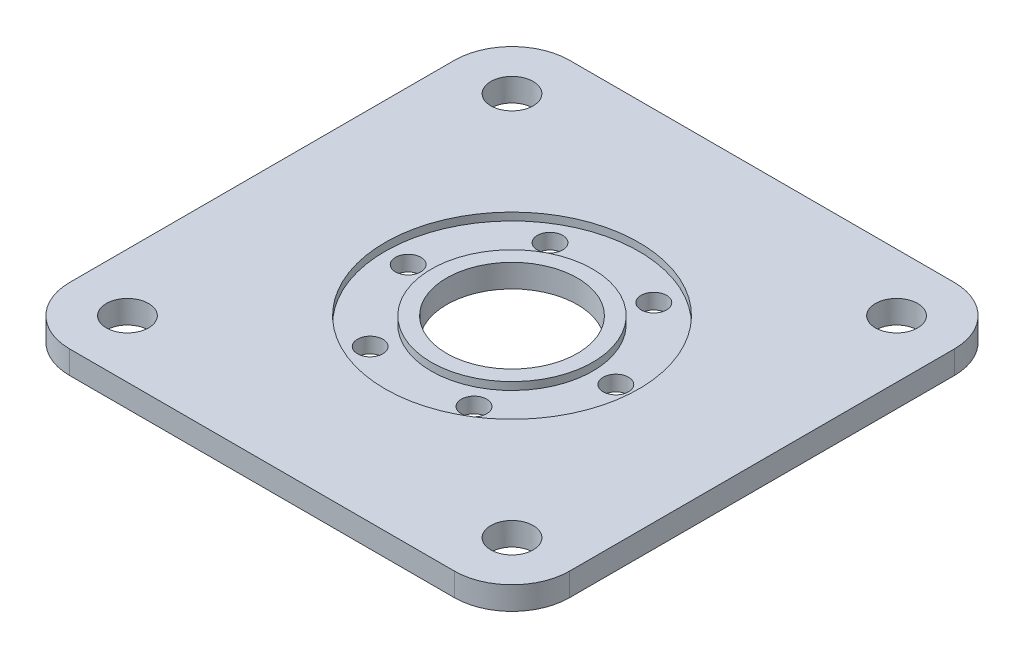
ISO-10303-21;
HEADER;
FILE_DESCRIPTION(('STEP AP214'),'2;1');
FILE_NAME('part.step','',(''),(''),'','','');
FILE_SCHEMA(('AUTOMOTIVE_DESIGN { 1 0 10303 214 1 1 1 1 }'));
ENDSEC;
DATA;
#1=APPLICATION_CONTEXT('core data for automotive mechanical design processes');
#2=APPLICATION_PROTOCOL_DEFINITION('international standard','automotive_design',2000,#1);
#3=PRODUCT_CONTEXT('',#1,'mechanical');
#4=PRODUCT('Part','Part','',(#3));
#5=PRODUCT_RELATED_PRODUCT_CATEGORY('part','',(#4));
#6=PRODUCT_DEFINITION_FORMATION('','',#4);
#7=PRODUCT_DEFINITION_CONTEXT('part definition',#1,'design');
#8=PRODUCT_DEFINITION('design','',#6,#7);
#9=PRODUCT_DEFINITION_SHAPE('','',#8);
#10=(LENGTH_UNIT() NAMED_UNIT(*) SI_UNIT(.MILLI.,.METRE.));
#11=(NAMED_UNIT(*) PLANE_ANGLE_UNIT() SI_UNIT($,.RADIAN.));
#12=(NAMED_UNIT(*) SI_UNIT($,.STERADIAN.) SOLID_ANGLE_UNIT());
#13=UNCERTAINTY_MEASURE_WITH_UNIT(LENGTH_MEASURE(1.E-05),#10,'distance_accuracy_value','');
#14=(GEOMETRIC_REPRESENTATION_CONTEXT(3) GLOBAL_UNCERTAINTY_ASSIGNED_CONTEXT((#13)) GLOBAL_UNIT_ASSIGNED_CONTEXT((#10,
#11,#12)) REPRESENTATION_CONTEXT('',''));
#15=CARTESIAN_POINT('',(0.,0.,0.));
#16=DIRECTION('',(0.,0.,1.));
#17=DIRECTION('',(1.,0.,0.));
#18=AXIS2_PLACEMENT_3D('',#15,#16,#17);
#19=CARTESIAN_POINT('',(-50.,6.,50.));
#20=DIRECTION('',(0.,-1.,0.));
#21=DIRECTION('',(0.,0.,-1.));
#22=AXIS2_PLACEMENT_3D('',#19,#20,#21);
#23=PLANE('',#22);
#24=CARTESIAN_POINT('',(0.,6.,0.));
#25=DIRECTION('',(0.,1.,0.));
#26=DIRECTION('',(0.,0.,1.));
#27=AXIS2_PLACEMENT_3D('',#24,#25,#26);
#28=CIRCLE('',#27,17.);
#29=CARTESIAN_POINT('',(0.,6.,17.));
#30=VERTEX_POINT('',#29);
#31=EDGE_CURVE('E135',#30,#30,#28,.T.);
#32=ORIENTED_EDGE('',*,*,#31,.F.);
#33=EDGE_LOOP('',(#32));
#34=FACE_BOUND('',#33,.T.);
#35=CARTESIAN_POINT('',(0.,6.,0.));
#36=DIRECTION('',(0.,1.,0.));
#37=DIRECTION('',(0.,0.,1.));
#38=AXIS2_PLACEMENT_3D('',#35,#36,#37);
#39=CIRCLE('',#38,21.);
#40=CARTESIAN_POINT('',(0.,6.,21.));
#41=VERTEX_POINT('',#40);
#42=EDGE_CURVE('E192',#41,#41,#39,.T.);
#43=ORIENTED_EDGE('',*,*,#42,.T.);
#44=EDGE_LOOP('',(#43));
#45=FACE_BOUND('',#44,.T.);
#46=ADVANCED_FACE('F34',(#34,#45),#23,.F.);
#47=CARTESIAN_POINT('',(-50.,6.,50.));
#48=DIRECTION('',(0.,-1.,0.));
#49=DIRECTION('',(0.,0.,-1.));
#50=AXIS2_PLACEMENT_3D('',#47,#48,#49);
#51=CIRCLE('',#50,5.5);
#52=CARTESIAN_POINT('',(-50.,6.,44.5));
#53=VERTEX_POINT('',#52);
#54=EDGE_CURVE('E195',#53,#53,#51,.T.);
#55=ORIENTED_EDGE('',*,*,#54,.T.);
#56=EDGE_LOOP('',(#55));
#57=FACE_BOUND('',#56,.T.);
#58=CARTESIAN_POINT('',(50.,6.,50.));
#59=DIRECTION('',(0.,-1.,0.));
#60=DIRECTION('',(0.,0.,-1.));
#61=AXIS2_PLACEMENT_3D('',#58,#59,#60);
#62=CIRCLE('',#61,5.49999999999999);
#63=CARTESIAN_POINT('',(50.,6.,44.5));
#64=VERTEX_POINT('',#63);
#65=EDGE_CURVE('E200',#64,#64,#62,.T.);
#66=ORIENTED_EDGE('',*,*,#65,.T.);
#67=EDGE_LOOP('',(#66));
#68=FACE_BOUND('',#67,.T.);
#69=CARTESIAN_POINT('',(50.,6.,-50.));
#70=DIRECTION('',(0.,-1.,0.));
#71=DIRECTION('',(0.,0.,-1.));
#72=AXIS2_PLACEMENT_3D('',#69,#70,#71);
#73=CIRCLE('',#72,5.49999999999999);
#74=CARTESIAN_POINT('',(50.,6.,-55.5));
#75=VERTEX_POINT('',#74);
#76=EDGE_CURVE('E203',#75,#75,#73,.T.);
#77=ORIENTED_EDGE('',*,*,#76,.T.);
#78=EDGE_LOOP('',(#77));
#79=FACE_BOUND('',#78,.T.);
#80=CARTESIAN_POINT('',(-50.,6.,-50.));
#81=DIRECTION('',(0.,-1.,0.));
#82=DIRECTION('',(0.,0.,-1.));
#83=AXIS2_PLACEMENT_3D('',#80,#81,#82);
#84=CIRCLE('',#83,5.5);
#85=CARTESIAN_POINT('',(-50.,6.,-55.5));
#86=VERTEX_POINT('',#85);
#87=EDGE_CURVE('E206',#86,#86,#84,.T.);
#88=ORIENTED_EDGE('',*,*,#87,.T.);
#89=EDGE_LOOP('',(#88));
#90=FACE_BOUND('',#89,.T.);
#91=CARTESIAN_POINT('',(0.,6.,0.));
#92=DIRECTION('',(0.,1.,0.));
#93=DIRECTION('',(0.,0.,1.));
#94=AXIS2_PLACEMENT_3D('',#91,#92,#93);
#95=CIRCLE('',#94,33.);
#96=CARTESIAN_POINT('',(0.,6.,33.));
#97=VERTEX_POINT('',#96);
#98=EDGE_CURVE('E186',#97,#97,#95,.T.);
#99=ORIENTED_EDGE('',*,*,#98,.F.);
#100=EDGE_LOOP('',(#99));
#101=FACE_BOUND('',#100,.T.);
#102=CARTESIAN_POINT('',(-50.,6.,50.));
#103=DIRECTION('',(0.,1.,0.));
#104=DIRECTION('',(0.,0.,-1.));
#105=AXIS2_PLACEMENT_3D('',#102,#103,#104);
#106=CIRCLE('',#105,15.);
#107=CARTESIAN_POINT('',(-65.,6.,50.));
#108=VERTEX_POINT('',#107);
#109=CARTESIAN_POINT('',(-50.,6.,65.));
#110=VERTEX_POINT('',#109);
#111=EDGE_CURVE('E146',#108,#110,#106,.T.);
#112=ORIENTED_EDGE('',*,*,#111,.T.);
#113=DIRECTION('',(1.,0.,0.));
#114=VECTOR('',#113,1.);
#115=CARTESIAN_POINT('',(-50.,6.,65.));
#116=LINE('',#115,#114);
#117=CARTESIAN_POINT('',(50.,6.,65.));
#118=VERTEX_POINT('',#117);
#119=EDGE_CURVE('E94',#110,#118,#116,.T.);
#120=ORIENTED_EDGE('',*,*,#119,.T.);
#121=CARTESIAN_POINT('',(50.,6.,50.));
#122=DIRECTION('',(0.,1.,0.));
#123=DIRECTION('',(0.,0.,1.));
#124=AXIS2_PLACEMENT_3D('',#121,#122,#123);
#125=CIRCLE('',#124,15.);
#126=CARTESIAN_POINT('',(65.,6.,50.));
#127=VERTEX_POINT('',#126);
#128=EDGE_CURVE('E161',#118,#127,#125,.T.);
#129=ORIENTED_EDGE('',*,*,#128,.T.);
#130=DIRECTION('',(0.,0.,-1.));
#131=VECTOR('',#130,1.);
#132=CARTESIAN_POINT('',(65.,6.,50.));
#133=LINE('',#132,#131);
#134=CARTESIAN_POINT('',(65.,6.,-50.));
#135=VERTEX_POINT('',#134);
#136=EDGE_CURVE('E174',#127,#135,#133,.T.);
#137=ORIENTED_EDGE('',*,*,#136,.T.);
#138=CARTESIAN_POINT('',(50.,6.,-50.));
#139=DIRECTION('',(0.,1.,0.));
#140=DIRECTION('',(0.,0.,1.));
#141=AXIS2_PLACEMENT_3D('',#138,#139,#140);
#142=CIRCLE('',#141,15.);
#143=CARTESIAN_POINT('',(50.,6.,-65.));
#144=VERTEX_POINT('',#143);
#145=EDGE_CURVE('E113',#135,#144,#142,.T.);
#146=ORIENTED_EDGE('',*,*,#145,.T.);
#147=DIRECTION('',(-1.,0.,0.));
#148=VECTOR('',#147,1.);
#149=CARTESIAN_POINT('',(-50.,6.,-65.));
#150=LINE('',#149,#148);
#151=CARTESIAN_POINT('',(-50.,6.,-65.));
#152=VERTEX_POINT('',#151);
#153=EDGE_CURVE('E107',#144,#152,#150,.T.);
#154=ORIENTED_EDGE('',*,*,#153,.T.);
#155=CARTESIAN_POINT('',(-50.,6.,-50.));
#156=DIRECTION('',(0.,1.,0.));
#157=DIRECTION('',(0.,0.,-1.));
#158=AXIS2_PLACEMENT_3D('',#155,#156,#157);
#159=CIRCLE('',#158,15.);
#160=CARTESIAN_POINT('',(-65.,6.,-50.));
#161=VERTEX_POINT('',#160);
#162=EDGE_CURVE('E111',#152,#161,#159,.T.);
#163=ORIENTED_EDGE('',*,*,#162,.T.);
#164=DIRECTION('',(0.,0.,1.));
#165=VECTOR('',#164,1.);
#166=CARTESIAN_POINT('',(-65.,6.,50.));
#167=LINE('',#166,#165);
#168=EDGE_CURVE('E51',#161,#108,#167,.T.);
#169=ORIENTED_EDGE('',*,*,#168,.T.);
#170=EDGE_LOOP('',(#112,#120,#129,#137,#146,#154,#163,#169));
#171=FACE_BOUND('',#170,.T.);
#172=ADVANCED_FACE('F109',(#57,#68,#79,#90,#101,#171),#23,.F.);
#173=CARTESIAN_POINT('',(-50.,0.,50.));
#174=DIRECTION('',(0.,-1.,0.));
#175=DIRECTION('',(0.,0.,-1.));
#176=AXIS2_PLACEMENT_3D('',#173,#174,#175);
#177=PLANE('',#176);
#178=CARTESIAN_POINT('',(-13.5000000000003,0.,-23.3826859021797));
#179=DIRECTION('',(0.,-1.,0.));
#180=DIRECTION('',(0.,0.,-1.));
#181=AXIS2_PLACEMENT_3D('',#178,#179,#180);
#182=CIRCLE('',#181,3.29999999999999);
#183=CARTESIAN_POINT('',(-13.5000000000003,0.,-26.6826859021797));
#184=VERTEX_POINT('',#183);
#185=EDGE_CURVE('E251',#184,#184,#182,.T.);
#186=ORIENTED_EDGE('',*,*,#185,.F.);
#187=EDGE_LOOP('',(#186));
#188=FACE_BOUND('',#187,.T.);
#189=CARTESIAN_POINT('',(13.4999999999998,0.,-23.38268590218));
#190=DIRECTION('',(0.,-1.,0.));
#191=DIRECTION('',(0.,0.,-1.));
#192=AXIS2_PLACEMENT_3D('',#189,#190,#191);
#193=CIRCLE('',#192,3.29999999999999);
#194=CARTESIAN_POINT('',(13.4999999999998,0.,-26.68268590218));
#195=VERTEX_POINT('',#194);
#196=EDGE_CURVE('E245',#195,#195,#193,.T.);
#197=ORIENTED_EDGE('',*,*,#196,.F.);
#198=EDGE_LOOP('',(#197));
#199=FACE_BOUND('',#198,.T.);
#200=CARTESIAN_POINT('',(27.,0.,0.));
#201=DIRECTION('',(0.,-1.,0.));
#202=DIRECTION('',(0.,0.,-1.));
#203=AXIS2_PLACEMENT_3D('',#200,#201,#202);
#204=CIRCLE('',#203,3.29999999999999);
#205=CARTESIAN_POINT('',(27.,0.,-3.29999999999999));
#206=VERTEX_POINT('',#205);
#207=EDGE_CURVE('E239',#206,#206,#204,.T.);
#208=ORIENTED_EDGE('',*,*,#207,.F.);
#209=EDGE_LOOP('',(#208));
#210=FACE_BOUND('',#209,.T.);
#211=CARTESIAN_POINT('',(13.5000000000001,0.,23.3826859021798));
#212=DIRECTION('',(0.,-1.,0.));
#213=DIRECTION('',(0.,0.,-1.));
#214=AXIS2_PLACEMENT_3D('',#211,#212,#213);
#215=CIRCLE('',#214,3.29999999999999);
#216=CARTESIAN_POINT('',(13.5000000000001,0.,20.0826859021798));
#217=VERTEX_POINT('',#216);
#218=EDGE_CURVE('E233',#217,#217,#215,.T.);
#219=ORIENTED_EDGE('',*,*,#218,.F.);
#220=EDGE_LOOP('',(#219));
#221=FACE_BOUND('',#220,.T.);
#222=CARTESIAN_POINT('',(-13.4999999999999,0.,23.3826859021799));
#223=DIRECTION('',(0.,-1.,0.));
#224=DIRECTION('',(0.,0.,-1.));
#225=AXIS2_PLACEMENT_3D('',#222,#223,#224);
#226=CIRCLE('',#225,3.29999999999999);
#227=CARTESIAN_POINT('',(-13.4999999999999,0.,20.0826859021799));
#228=VERTEX_POINT('',#227);
#229=EDGE_CURVE('E227',#228,#228,#226,.T.);
#230=ORIENTED_EDGE('',*,*,#229,.F.);
#231=EDGE_LOOP('',(#230));
#232=FACE_BOUND('',#231,.T.);
#233=CARTESIAN_POINT('',(-27.,0.,0.));
#234=DIRECTION('',(0.,-1.,0.));
#235=DIRECTION('',(0.,0.,-1.));
#236=AXIS2_PLACEMENT_3D('',#233,#234,#235);
#237=CIRCLE('',#236,3.29999999999999);
#238=CARTESIAN_POINT('',(-27.,0.,-3.29999999999999));
#239=VERTEX_POINT('',#238);
#240=EDGE_CURVE('E217',#239,#239,#237,.T.);
#241=ORIENTED_EDGE('',*,*,#240,.F.);
#242=EDGE_LOOP('',(#241));
#243=FACE_BOUND('',#242,.T.);
#244=CARTESIAN_POINT('',(-50.,0.,50.));
#245=DIRECTION('',(0.,1.,0.));
#246=DIRECTION('',(0.,0.,1.));
#247=AXIS2_PLACEMENT_3D('',#244,#245,#246);
#248=CIRCLE('',#247,5.5);
#249=CARTESIAN_POINT('',(-50.,0.,55.5));
#250=VERTEX_POINT('',#249);
#251=EDGE_CURVE('E213',#250,#250,#248,.T.);
#252=ORIENTED_EDGE('',*,*,#251,.T.);
#253=EDGE_LOOP('',(#252));
#254=FACE_BOUND('',#253,.T.);
#255=CARTESIAN_POINT('',(50.,0.,50.));
#256=DIRECTION('',(0.,1.,0.));
#257=DIRECTION('',(0.,0.,1.));
#258=AXIS2_PLACEMENT_3D('',#255,#256,#257);
#259=CIRCLE('',#258,5.49999999999999);
#260=CARTESIAN_POINT('',(50.,0.,55.5));
#261=VERTEX_POINT('',#260);
#262=EDGE_CURVE('E216',#261,#261,#259,.T.);
#263=ORIENTED_EDGE('',*,*,#262,.T.);
#264=EDGE_LOOP('',(#263));
#265=FACE_BOUND('',#264,.T.);
#266=CARTESIAN_POINT('',(50.,0.,-50.));
#267=DIRECTION('',(0.,1.,0.));
#268=DIRECTION('',(0.,0.,1.));
#269=AXIS2_PLACEMENT_3D('',#266,#267,#268);
#270=CIRCLE('',#269,5.49999999999999);
#271=CARTESIAN_POINT('',(50.,0.,-44.5));
#272=VERTEX_POINT('',#271);
#273=EDGE_CURVE('E212',#272,#272,#270,.T.);
#274=ORIENTED_EDGE('',*,*,#273,.T.);
#275=EDGE_LOOP('',(#274));
#276=FACE_BOUND('',#275,.T.);
#277=CARTESIAN_POINT('',(-50.,0.,-50.));
#278=DIRECTION('',(0.,1.,0.));
#279=DIRECTION('',(0.,0.,1.));
#280=AXIS2_PLACEMENT_3D('',#277,#278,#279);
#281=CIRCLE('',#280,5.5);
#282=CARTESIAN_POINT('',(-50.,0.,-44.5));
#283=VERTEX_POINT('',#282);
#284=EDGE_CURVE('E209',#283,#283,#281,.T.);
#285=ORIENTED_EDGE('',*,*,#284,.T.);
#286=EDGE_LOOP('',(#285));
#287=FACE_BOUND('',#286,.T.);
#288=CARTESIAN_POINT('',(-50.,0.,50.));
#289=DIRECTION('',(0.,1.,0.));
#290=DIRECTION('',(0.,0.,-1.));
#291=AXIS2_PLACEMENT_3D('',#288,#289,#290);
#292=CIRCLE('',#291,15.);
#293=CARTESIAN_POINT('',(-65.,0.,50.));
#294=VERTEX_POINT('',#293);
#295=CARTESIAN_POINT('',(-50.,0.,65.));
#296=VERTEX_POINT('',#295);
#297=EDGE_CURVE('E131',#294,#296,#292,.T.);
#298=ORIENTED_EDGE('',*,*,#297,.F.);
#299=DIRECTION('',(0.,0.,1.));
#300=VECTOR('',#299,1.);
#301=CARTESIAN_POINT('',(-65.,0.,50.));
#302=LINE('',#301,#300);
#303=CARTESIAN_POINT('',(-65.,0.,-50.));
#304=VERTEX_POINT('',#303);
#305=EDGE_CURVE('E86',#304,#294,#302,.T.);
#306=ORIENTED_EDGE('',*,*,#305,.F.);
#307=CARTESIAN_POINT('',(-50.,0.,-50.));
#308=DIRECTION('',(0.,1.,0.));
#309=DIRECTION('',(0.,0.,-1.));
#310=AXIS2_PLACEMENT_3D('',#307,#308,#309);
#311=CIRCLE('',#310,15.);
#312=CARTESIAN_POINT('',(-50.,0.,-65.));
#313=VERTEX_POINT('',#312);
#314=EDGE_CURVE('E80',#313,#304,#311,.T.);
#315=ORIENTED_EDGE('',*,*,#314,.F.);
#316=DIRECTION('',(-1.,0.,0.));
#317=VECTOR('',#316,1.);
#318=CARTESIAN_POINT('',(-50.,0.,-65.));
#319=LINE('',#318,#317);
#320=CARTESIAN_POINT('',(50.,0.,-65.));
#321=VERTEX_POINT('',#320);
#322=EDGE_CURVE('E121',#321,#313,#319,.T.);
#323=ORIENTED_EDGE('',*,*,#322,.F.);
#324=CARTESIAN_POINT('',(50.,0.,-50.));
#325=DIRECTION('',(0.,1.,0.));
#326=DIRECTION('',(0.,0.,1.));
#327=AXIS2_PLACEMENT_3D('',#324,#325,#326);
#328=CIRCLE('',#327,15.);
#329=CARTESIAN_POINT('',(65.,0.,-50.));
#330=VERTEX_POINT('',#329);
#331=EDGE_CURVE('E141',#330,#321,#328,.T.);
#332=ORIENTED_EDGE('',*,*,#331,.F.);
#333=DIRECTION('',(0.,0.,-1.));
#334=VECTOR('',#333,1.);
#335=CARTESIAN_POINT('',(65.,0.,50.));
#336=LINE('',#335,#334);
#337=CARTESIAN_POINT('',(65.,0.,50.));
#338=VERTEX_POINT('',#337);
#339=EDGE_CURVE('E139',#338,#330,#336,.T.);
#340=ORIENTED_EDGE('',*,*,#339,.F.);
#341=CARTESIAN_POINT('',(50.,0.,50.));
#342=DIRECTION('',(0.,1.,0.));
#343=DIRECTION('',(0.,0.,1.));
#344=AXIS2_PLACEMENT_3D('',#341,#342,#343);
#345=CIRCLE('',#344,15.);
#346=CARTESIAN_POINT('',(50.,0.,65.));
#347=VERTEX_POINT('',#346);
#348=EDGE_CURVE('E137',#347,#338,#345,.T.);
#349=ORIENTED_EDGE('',*,*,#348,.F.);
#350=DIRECTION('',(1.,0.,0.));
#351=VECTOR('',#350,1.);
#352=CARTESIAN_POINT('',(-50.,0.,65.));
#353=LINE('',#352,#351);
#354=EDGE_CURVE('E134',#296,#347,#353,.T.);
#355=ORIENTED_EDGE('',*,*,#354,.F.);
#356=EDGE_LOOP('',(#298,#306,#315,#323,#332,#340,#349,#355));
#357=FACE_BOUND('',#356,.T.);
#358=CARTESIAN_POINT('',(0.,0.,0.));
#359=DIRECTION('',(0.,1.,0.));
#360=DIRECTION('',(0.,0.,1.));
#361=AXIS2_PLACEMENT_3D('',#358,#359,#360);
#362=CIRCLE('',#361,17.);
#363=CARTESIAN_POINT('',(0.,0.,17.));
#364=VERTEX_POINT('',#363);
#365=EDGE_CURVE('E180',#364,#364,#362,.T.);
#366=ORIENTED_EDGE('',*,*,#365,.T.);
#367=EDGE_LOOP('',(#366));
#368=FACE_BOUND('',#367,.T.);
#369=ADVANCED_FACE('F165',(#188,#199,#210,#221,#232,#243,#254,#265,#276,#287,#357,#368),#177,.T.);
#370=CARTESIAN_POINT('',(-50.,6.,50.));
#371=DIRECTION('',(0.,-1.,0.));
#372=DIRECTION('',(0.,0.,-1.));
#373=AXIS2_PLACEMENT_3D('',#370,#371,#372);
#374=CYLINDRICAL_SURFACE('',#373,15.);
#375=ORIENTED_EDGE('',*,*,#297,.T.);
#376=DIRECTION('',(0.,-1.,0.));
#377=VECTOR('',#376,1.);
#378=CARTESIAN_POINT('',(-50.,6.,65.));
#379=LINE('',#378,#377);
#380=EDGE_CURVE('E11',#110,#296,#379,.T.);
#381=ORIENTED_EDGE('',*,*,#380,.F.);
#382=ORIENTED_EDGE('',*,*,#111,.F.);
#383=DIRECTION('',(0.,-1.,0.));
#384=VECTOR('',#383,1.);
#385=CARTESIAN_POINT('',(-65.,6.,50.));
#386=LINE('',#385,#384);
#387=EDGE_CURVE('E127',#108,#294,#386,.T.);
#388=ORIENTED_EDGE('',*,*,#387,.T.);
#389=EDGE_LOOP('',(#375,#381,#382,#388));
#390=FACE_BOUND('',#389,.T.);
#391=ADVANCED_FACE('F36',(#390),#374,.T.);
#392=CARTESIAN_POINT('',(-50.,6.,65.));
#393=DIRECTION('',(0.,0.,-1.));
#394=DIRECTION('',(-1.,0.,0.));
#395=AXIS2_PLACEMENT_3D('',#392,#393,#394);
#396=PLANE('',#395);
#397=ORIENTED_EDGE('',*,*,#354,.T.);
#398=DIRECTION('',(0.,-1.,0.));
#399=VECTOR('',#398,1.);
#400=CARTESIAN_POINT('',(50.,6.,65.));
#401=LINE('',#400,#399);
#402=EDGE_CURVE('E43',#118,#347,#401,.T.);
#403=ORIENTED_EDGE('',*,*,#402,.F.);
#404=ORIENTED_EDGE('',*,*,#119,.F.);
#405=ORIENTED_EDGE('',*,*,#380,.T.);
#406=EDGE_LOOP('',(#397,#403,#404,#405));
#407=FACE_BOUND('',#406,.T.);
#408=ADVANCED_FACE('F312',(#407),#396,.F.);
#409=CARTESIAN_POINT('',(50.,6.,50.));
#410=DIRECTION('',(0.,-1.,0.));
#411=DIRECTION('',(0.,0.,-1.));
#412=AXIS2_PLACEMENT_3D('',#409,#410,#411);
#413=CYLINDRICAL_SURFACE('',#412,15.);
#414=ORIENTED_EDGE('',*,*,#348,.T.);
#415=DIRECTION('',(0.,-1.,0.));
#416=VECTOR('',#415,1.);
#417=CARTESIAN_POINT('',(65.,6.,50.));
#418=LINE('',#417,#416);
#419=EDGE_CURVE('E153',#127,#338,#418,.T.);
#420=ORIENTED_EDGE('',*,*,#419,.F.);
#421=ORIENTED_EDGE('',*,*,#128,.F.);
#422=ORIENTED_EDGE('',*,*,#402,.T.);
#423=EDGE_LOOP('',(#414,#420,#421,#422));
#424=FACE_BOUND('',#423,.T.);
#425=ADVANCED_FACE('F159',(#424),#413,.T.);
#426=CARTESIAN_POINT('',(65.,6.,50.));
#427=DIRECTION('',(-1.,0.,0.));
#428=DIRECTION('',(0.,0.,1.));
#429=AXIS2_PLACEMENT_3D('',#426,#427,#428);
#430=PLANE('',#429);
#431=ORIENTED_EDGE('',*,*,#339,.T.);
#432=DIRECTION('',(0.,-1.,0.));
#433=VECTOR('',#432,1.);
#434=CARTESIAN_POINT('',(65.,6.,-50.));
#435=LINE('',#434,#433);
#436=EDGE_CURVE('E150',#135,#330,#435,.T.);
#437=ORIENTED_EDGE('',*,*,#436,.F.);
#438=ORIENTED_EDGE('',*,*,#136,.F.);
#439=ORIENTED_EDGE('',*,*,#419,.T.);
#440=EDGE_LOOP('',(#431,#437,#438,#439));
#441=FACE_BOUND('',#440,.T.);
#442=ADVANCED_FACE('F170',(#441),#430,.F.);
#443=CARTESIAN_POINT('',(50.,6.,-50.));
#444=DIRECTION('',(0.,-1.,0.));
#445=DIRECTION('',(0.,0.,-1.));
#446=AXIS2_PLACEMENT_3D('',#443,#444,#445);
#447=CYLINDRICAL_SURFACE('',#446,15.);
#448=ORIENTED_EDGE('',*,*,#331,.T.);
#449=DIRECTION('',(0.,-1.,0.));
#450=VECTOR('',#449,1.);
#451=CARTESIAN_POINT('',(50.,6.,-65.));
#452=LINE('',#451,#450);
#453=EDGE_CURVE('E122',#144,#321,#452,.T.);
#454=ORIENTED_EDGE('',*,*,#453,.F.);
#455=ORIENTED_EDGE('',*,*,#145,.F.);
#456=ORIENTED_EDGE('',*,*,#436,.T.);
#457=EDGE_LOOP('',(#448,#454,#455,#456));
#458=FACE_BOUND('',#457,.T.);
#459=ADVANCED_FACE('F173',(#458),#447,.T.);
#460=CARTESIAN_POINT('',(-50.,6.,-65.));
#461=DIRECTION('',(0.,0.,1.));
#462=DIRECTION('',(1.,0.,0.));
#463=AXIS2_PLACEMENT_3D('',#460,#461,#462);
#464=PLANE('',#463);
#465=ORIENTED_EDGE('',*,*,#322,.T.);
#466=DIRECTION('',(0.,-1.,0.));
#467=VECTOR('',#466,1.);
#468=CARTESIAN_POINT('',(-50.,6.,-65.));
#469=LINE('',#468,#467);
#470=EDGE_CURVE('E118',#152,#313,#469,.T.);
#471=ORIENTED_EDGE('',*,*,#470,.F.);
#472=ORIENTED_EDGE('',*,*,#153,.F.);
#473=ORIENTED_EDGE('',*,*,#453,.T.);
#474=EDGE_LOOP('',(#465,#471,#472,#473));
#475=FACE_BOUND('',#474,.T.);
#476=ADVANCED_FACE('F119',(#475),#464,.F.);
#477=CARTESIAN_POINT('',(-50.,6.,-50.));
#478=DIRECTION('',(0.,-1.,0.));
#479=DIRECTION('',(0.,0.,-1.));
#480=AXIS2_PLACEMENT_3D('',#477,#478,#479);
#481=CYLINDRICAL_SURFACE('',#480,15.);
#482=ORIENTED_EDGE('',*,*,#314,.T.);
#483=DIRECTION('',(0.,-1.,0.));
#484=VECTOR('',#483,1.);
#485=CARTESIAN_POINT('',(-65.,6.,-50.));
#486=LINE('',#485,#484);
#487=EDGE_CURVE('E123',#161,#304,#486,.T.);
#488=ORIENTED_EDGE('',*,*,#487,.F.);
#489=ORIENTED_EDGE('',*,*,#162,.F.);
#490=ORIENTED_EDGE('',*,*,#470,.T.);
#491=EDGE_LOOP('',(#482,#488,#489,#490));
#492=FACE_BOUND('',#491,.T.);
#493=ADVANCED_FACE('F125',(#492),#481,.T.);
#494=CARTESIAN_POINT('',(-65.,6.,50.));
#495=DIRECTION('',(1.,0.,0.));
#496=DIRECTION('',(0.,0.,-1.));
#497=AXIS2_PLACEMENT_3D('',#494,#495,#496);
#498=PLANE('',#497);
#499=ORIENTED_EDGE('',*,*,#305,.T.);
#500=ORIENTED_EDGE('',*,*,#387,.F.);
#501=ORIENTED_EDGE('',*,*,#168,.F.);
#502=ORIENTED_EDGE('',*,*,#487,.T.);
#503=EDGE_LOOP('',(#499,#500,#501,#502));
#504=FACE_BOUND('',#503,.T.);
#505=ADVANCED_FACE('F300',(#504),#498,.F.);
#506=CARTESIAN_POINT('',(0.,6.,0.));
#507=DIRECTION('',(0.,-1.,0.));
#508=DIRECTION('',(0.,0.,-1.));
#509=AXIS2_PLACEMENT_3D('',#506,#507,#508);
#510=CYLINDRICAL_SURFACE('',#509,17.);
#511=ORIENTED_EDGE('',*,*,#31,.T.);
#512=EDGE_LOOP('',(#511));
#513=FACE_BOUND('',#512,.T.);
#514=ORIENTED_EDGE('',*,*,#365,.F.);
#515=EDGE_LOOP('',(#514));
#516=FACE_BOUND('',#515,.T.);
#517=ADVANCED_FACE('F283',(#513,#516),#510,.F.);
#518=CARTESIAN_POINT('',(0.,4.,0.));
#519=DIRECTION('',(0.,1.,0.));
#520=DIRECTION('',(0.,0.,1.));
#521=AXIS2_PLACEMENT_3D('',#518,#519,#520);
#522=CYLINDRICAL_SURFACE('',#521,33.);
#523=CARTESIAN_POINT('',(0.,4.,0.));
#524=DIRECTION('',(0.,1.,0.));
#525=DIRECTION('',(0.,0.,1.));
#526=AXIS2_PLACEMENT_3D('',#523,#524,#525);
#527=CIRCLE('',#526,33.);
#528=CARTESIAN_POINT('',(0.,4.,33.));
#529=VERTEX_POINT('',#528);
#530=EDGE_CURVE('E183',#529,#529,#527,.T.);
#531=ORIENTED_EDGE('',*,*,#530,.F.);
#532=EDGE_LOOP('',(#531));
#533=FACE_BOUND('',#532,.T.);
#534=ORIENTED_EDGE('',*,*,#98,.T.);
#535=EDGE_LOOP('',(#534));
#536=FACE_BOUND('',#535,.T.);
#537=ADVANCED_FACE('F265',(#533,#536),#522,.F.);
#538=CARTESIAN_POINT('',(0.,4.,0.));
#539=DIRECTION('',(0.,1.,0.));
#540=DIRECTION('',(0.,0.,1.));
#541=AXIS2_PLACEMENT_3D('',#538,#539,#540);
#542=PLANE('',#541);
#543=CARTESIAN_POINT('',(-13.5000000000003,4.,-23.3826859021797));
#544=DIRECTION('',(0.,1.,0.));
#545=DIRECTION('',(0.,0.,1.));
#546=AXIS2_PLACEMENT_3D('',#543,#544,#545);
#547=CIRCLE('',#546,3.29999999999999);
#548=CARTESIAN_POINT('',(-13.5000000000003,4.,-20.0826859021797));
#549=VERTEX_POINT('',#548);
#550=EDGE_CURVE('E254',#549,#549,#547,.T.);
#551=ORIENTED_EDGE('',*,*,#550,.F.);
#552=EDGE_LOOP('',(#551));
#553=FACE_BOUND('',#552,.T.);
#554=CARTESIAN_POINT('',(13.4999999999998,4.,-23.38268590218));
#555=DIRECTION('',(0.,1.,0.));
#556=DIRECTION('',(0.,0.,1.));
#557=AXIS2_PLACEMENT_3D('',#554,#555,#556);
#558=CIRCLE('',#557,3.29999999999999);
#559=CARTESIAN_POINT('',(13.4999999999998,4.,-20.08268590218));
#560=VERTEX_POINT('',#559);
#561=EDGE_CURVE('E248',#560,#560,#558,.T.);
#562=ORIENTED_EDGE('',*,*,#561,.F.);
#563=EDGE_LOOP('',(#562));
#564=FACE_BOUND('',#563,.T.);
#565=CARTESIAN_POINT('',(27.,4.,0.));
#566=DIRECTION('',(0.,1.,0.));
#567=DIRECTION('',(0.,0.,1.));
#568=AXIS2_PLACEMENT_3D('',#565,#566,#567);
#569=CIRCLE('',#568,3.29999999999999);
#570=CARTESIAN_POINT('',(27.,4.,3.29999999999999));
#571=VERTEX_POINT('',#570);
#572=EDGE_CURVE('E242',#571,#571,#569,.T.);
#573=ORIENTED_EDGE('',*,*,#572,.F.);
#574=EDGE_LOOP('',(#573));
#575=FACE_BOUND('',#574,.T.);
#576=CARTESIAN_POINT('',(13.5000000000001,4.,23.3826859021798));
#577=DIRECTION('',(0.,1.,0.));
#578=DIRECTION('',(0.,0.,1.));
#579=AXIS2_PLACEMENT_3D('',#576,#577,#578);
#580=CIRCLE('',#579,3.29999999999999);
#581=CARTESIAN_POINT('',(13.5000000000001,4.,26.6826859021798));
#582=VERTEX_POINT('',#581);
#583=EDGE_CURVE('E236',#582,#582,#580,.T.);
#584=ORIENTED_EDGE('',*,*,#583,.F.);
#585=EDGE_LOOP('',(#584));
#586=FACE_BOUND('',#585,.T.);
#587=CARTESIAN_POINT('',(-13.4999999999999,4.,23.3826859021799));
#588=DIRECTION('',(0.,1.,0.));
#589=DIRECTION('',(0.,0.,1.));
#590=AXIS2_PLACEMENT_3D('',#587,#588,#589);
#591=CIRCLE('',#590,3.29999999999999);
#592=CARTESIAN_POINT('',(-13.4999999999999,4.,26.6826859021799));
#593=VERTEX_POINT('',#592);
#594=EDGE_CURVE('E230',#593,#593,#591,.T.);
#595=ORIENTED_EDGE('',*,*,#594,.F.);
#596=EDGE_LOOP('',(#595));
#597=FACE_BOUND('',#596,.T.);
#598=CARTESIAN_POINT('',(-27.,4.,0.));
#599=DIRECTION('',(0.,1.,0.));
#600=DIRECTION('',(0.,0.,1.));
#601=AXIS2_PLACEMENT_3D('',#598,#599,#600);
#602=CIRCLE('',#601,3.29999999999999);
#603=CARTESIAN_POINT('',(-27.,4.,3.29999999999999));
#604=VERTEX_POINT('',#603);
#605=EDGE_CURVE('E224',#604,#604,#602,.T.);
#606=ORIENTED_EDGE('',*,*,#605,.F.);
#607=EDGE_LOOP('',(#606));
#608=FACE_BOUND('',#607,.T.);
#609=CARTESIAN_POINT('',(0.,4.,0.));
#610=DIRECTION('',(0.,1.,0.));
#611=DIRECTION('',(0.,0.,1.));
#612=AXIS2_PLACEMENT_3D('',#609,#610,#611);
#613=CIRCLE('',#612,21.);
#614=CARTESIAN_POINT('',(0.,4.,21.));
#615=VERTEX_POINT('',#614);
#616=EDGE_CURVE('E189',#615,#615,#613,.T.);
#617=ORIENTED_EDGE('',*,*,#616,.F.);
#618=EDGE_LOOP('',(#617));
#619=FACE_BOUND('',#618,.T.);
#620=ORIENTED_EDGE('',*,*,#530,.T.);
#621=EDGE_LOOP('',(#620));
#622=FACE_BOUND('',#621,.T.);
#623=ADVANCED_FACE('F261',(#553,#564,#575,#586,#597,#608,#619,#622),#542,.T.);
#624=CARTESIAN_POINT('',(0.,4.,0.));
#625=DIRECTION('',(0.,1.,0.));
#626=DIRECTION('',(0.,0.,1.));
#627=AXIS2_PLACEMENT_3D('',#624,#625,#626);
#628=CYLINDRICAL_SURFACE('',#627,21.);
#629=ORIENTED_EDGE('',*,*,#616,.T.);
#630=EDGE_LOOP('',(#629));
#631=FACE_BOUND('',#630,.T.);
#632=ORIENTED_EDGE('',*,*,#42,.F.);
#633=EDGE_LOOP('',(#632));
#634=FACE_BOUND('',#633,.T.);
#635=ADVANCED_FACE('F264',(#631,#634),#628,.T.);
#636=CARTESIAN_POINT('',(-50.,0.,-50.));
#637=DIRECTION('',(0.,1.,0.));
#638=DIRECTION('',(0.,0.,1.));
#639=AXIS2_PLACEMENT_3D('',#636,#637,#638);
#640=CYLINDRICAL_SURFACE('',#639,5.5);
#641=ORIENTED_EDGE('',*,*,#284,.F.);
#642=EDGE_LOOP('',(#641));
#643=FACE_BOUND('',#642,.T.);
#644=ORIENTED_EDGE('',*,*,#87,.F.);
#645=EDGE_LOOP('',(#644));
#646=FACE_BOUND('',#645,.T.);
#647=ADVANCED_FACE('F402',(#643,#646),#640,.F.);
#648=CARTESIAN_POINT('',(50.,0.,-50.));
#649=DIRECTION('',(0.,1.,0.));
#650=DIRECTION('',(0.,0.,1.));
#651=AXIS2_PLACEMENT_3D('',#648,#649,#650);
#652=CYLINDRICAL_SURFACE('',#651,5.49999999999999);
#653=ORIENTED_EDGE('',*,*,#273,.F.);
#654=EDGE_LOOP('',(#653));
#655=FACE_BOUND('',#654,.T.);
#656=ORIENTED_EDGE('',*,*,#76,.F.);
#657=EDGE_LOOP('',(#656));
#658=FACE_BOUND('',#657,.T.);
#659=ADVANCED_FACE('F398',(#655,#658),#652,.F.);
#660=CARTESIAN_POINT('',(50.,0.,50.));
#661=DIRECTION('',(0.,1.,0.));
#662=DIRECTION('',(0.,0.,1.));
#663=AXIS2_PLACEMENT_3D('',#660,#661,#662);
#664=CYLINDRICAL_SURFACE('',#663,5.49999999999999);
#665=ORIENTED_EDGE('',*,*,#262,.F.);
#666=EDGE_LOOP('',(#665));
#667=FACE_BOUND('',#666,.T.);
#668=ORIENTED_EDGE('',*,*,#65,.F.);
#669=EDGE_LOOP('',(#668));
#670=FACE_BOUND('',#669,.T.);
#671=ADVANCED_FACE('F401',(#667,#670),#664,.F.);
#672=CARTESIAN_POINT('',(-50.,0.,50.));
#673=DIRECTION('',(0.,1.,0.));
#674=DIRECTION('',(0.,0.,1.));
#675=AXIS2_PLACEMENT_3D('',#672,#673,#674);
#676=CYLINDRICAL_SURFACE('',#675,5.5);
#677=ORIENTED_EDGE('',*,*,#251,.F.);
#678=EDGE_LOOP('',(#677));
#679=FACE_BOUND('',#678,.T.);
#680=ORIENTED_EDGE('',*,*,#54,.F.);
#681=EDGE_LOOP('',(#680));
#682=FACE_BOUND('',#681,.T.);
#683=ADVANCED_FACE('F396',(#679,#682),#676,.F.);
#684=CARTESIAN_POINT('',(-27.,4.,0.));
#685=DIRECTION('',(0.,1.,0.));
#686=DIRECTION('',(0.,0.,1.));
#687=AXIS2_PLACEMENT_3D('',#684,#685,#686);
#688=CYLINDRICAL_SURFACE('',#687,3.29999999999999);
#689=ORIENTED_EDGE('',*,*,#605,.T.);
#690=EDGE_LOOP('',(#689));
#691=FACE_BOUND('',#690,.T.);
#692=ORIENTED_EDGE('',*,*,#240,.T.);
#693=EDGE_LOOP('',(#692));
#694=FACE_BOUND('',#693,.T.);
#695=ADVANCED_FACE('F333',(#691,#694),#688,.F.);
#696=CARTESIAN_POINT('',(-13.4999999999999,4.,23.3826859021799));
#697=DIRECTION('',(0.,1.,0.));
#698=DIRECTION('',(0.,0.,1.));
#699=AXIS2_PLACEMENT_3D('',#696,#697,#698);
#700=CYLINDRICAL_SURFACE('',#699,3.29999999999999);
#701=ORIENTED_EDGE('',*,*,#594,.T.);
#702=EDGE_LOOP('',(#701));
#703=FACE_BOUND('',#702,.T.);
#704=ORIENTED_EDGE('',*,*,#229,.T.);
#705=EDGE_LOOP('',(#704));
#706=FACE_BOUND('',#705,.T.);
#707=ADVANCED_FACE('F347',(#703,#706),#700,.F.);
#708=CARTESIAN_POINT('',(13.5000000000001,4.,23.3826859021798));
#709=DIRECTION('',(0.,1.,0.));
#710=DIRECTION('',(0.,0.,1.));
#711=AXIS2_PLACEMENT_3D('',#708,#709,#710);
#712=CYLINDRICAL_SURFACE('',#711,3.29999999999999);
#713=ORIENTED_EDGE('',*,*,#583,.T.);
#714=EDGE_LOOP('',(#713));
#715=FACE_BOUND('',#714,.T.);
#716=ORIENTED_EDGE('',*,*,#218,.T.);
#717=EDGE_LOOP('',(#716));
#718=FACE_BOUND('',#717,.T.);
#719=ADVANCED_FACE('F352',(#715,#718),#712,.F.);
#720=CARTESIAN_POINT('',(27.,4.,0.));
#721=DIRECTION('',(0.,1.,0.));
#722=DIRECTION('',(0.,0.,1.));
#723=AXIS2_PLACEMENT_3D('',#720,#721,#722);
#724=CYLINDRICAL_SURFACE('',#723,3.29999999999999);
#725=ORIENTED_EDGE('',*,*,#572,.T.);
#726=EDGE_LOOP('',(#725));
#727=FACE_BOUND('',#726,.T.);
#728=ORIENTED_EDGE('',*,*,#207,.T.);
#729=EDGE_LOOP('',(#728));
#730=FACE_BOUND('',#729,.T.);
#731=ADVANCED_FACE('F362',(#727,#730),#724,.F.);
#732=CARTESIAN_POINT('',(13.4999999999998,4.,-23.38268590218));
#733=DIRECTION('',(0.,1.,0.));
#734=DIRECTION('',(0.,0.,1.));
#735=AXIS2_PLACEMENT_3D('',#732,#733,#734);
#736=CYLINDRICAL_SURFACE('',#735,3.29999999999999);
#737=ORIENTED_EDGE('',*,*,#561,.T.);
#738=EDGE_LOOP('',(#737));
#739=FACE_BOUND('',#738,.T.);
#740=ORIENTED_EDGE('',*,*,#196,.T.);
#741=EDGE_LOOP('',(#740));
#742=FACE_BOUND('',#741,.T.);
#743=ADVANCED_FACE('F372',(#739,#742),#736,.F.);
#744=CARTESIAN_POINT('',(-13.5000000000003,4.,-23.3826859021797));
#745=DIRECTION('',(0.,1.,0.));
#746=DIRECTION('',(0.,0.,1.));
#747=AXIS2_PLACEMENT_3D('',#744,#745,#746);
#748=CYLINDRICAL_SURFACE('',#747,3.29999999999999);
#749=ORIENTED_EDGE('',*,*,#550,.T.);
#750=EDGE_LOOP('',(#749));
#751=FACE_BOUND('',#750,.T.);
#752=ORIENTED_EDGE('',*,*,#185,.T.);
#753=EDGE_LOOP('',(#752));
#754=FACE_BOUND('',#753,.T.);
#755=ADVANCED_FACE('F258',(#751,#754),#748,.F.);
#756=CLOSED_SHELL('',(#46,#172,#369,#391,#408,#425,#442,#459,#476,#493,#505,#517,#537,#623,#635,
#647,#659,#671,#683,#695,#707,#719,#731,#743,#755));
#757=MANIFOLD_SOLID_BREP('B2',#756);
#758=ADVANCED_BREP_SHAPE_REPRESENTATION('',(#18,#757),#14);
#759=SHAPE_DEFINITION_REPRESENTATION(#9,#758);
ENDSEC;
END-ISO-10303-21;
